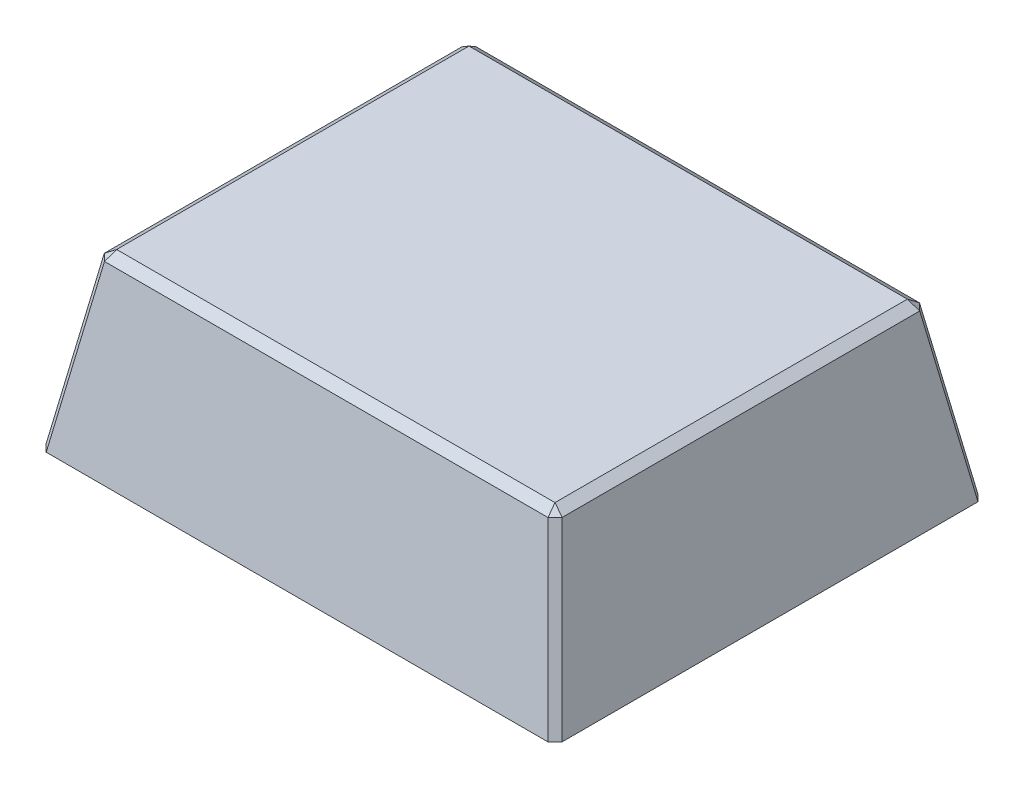
ISO-10303-21;
HEADER;
FILE_DESCRIPTION(('STEP AP214'),'2;1');
FILE_NAME('part.step','',(''),(''),'','','');
FILE_SCHEMA(('AUTOMOTIVE_DESIGN { 1 0 10303 214 1 1 1 1 }'));
ENDSEC;
DATA;
#1=APPLICATION_CONTEXT('core data for automotive mechanical design processes');
#2=APPLICATION_PROTOCOL_DEFINITION('international standard','automotive_design',2000,#1);
#3=PRODUCT_CONTEXT('',#1,'mechanical');
#4=PRODUCT('Part','Part','',(#3));
#5=PRODUCT_RELATED_PRODUCT_CATEGORY('part','',(#4));
#6=PRODUCT_DEFINITION_FORMATION('','',#4);
#7=PRODUCT_DEFINITION_CONTEXT('part definition',#1,'design');
#8=PRODUCT_DEFINITION('design','',#6,#7);
#9=PRODUCT_DEFINITION_SHAPE('','',#8);
#10=(LENGTH_UNIT() NAMED_UNIT(*) SI_UNIT(.MILLI.,.METRE.));
#11=(NAMED_UNIT(*) PLANE_ANGLE_UNIT() SI_UNIT($,.RADIAN.));
#12=(NAMED_UNIT(*) SI_UNIT($,.STERADIAN.) SOLID_ANGLE_UNIT());
#13=UNCERTAINTY_MEASURE_WITH_UNIT(LENGTH_MEASURE(1.E-05),#10,'distance_accuracy_value','');
#14=(GEOMETRIC_REPRESENTATION_CONTEXT(3) GLOBAL_UNCERTAINTY_ASSIGNED_CONTEXT((#13)) GLOBAL_UNIT_ASSIGNED_CONTEXT((#10,
#11,#12)) REPRESENTATION_CONTEXT('',''));
#15=CARTESIAN_POINT('',(0.,0.,0.));
#16=DIRECTION('',(0.,0.,1.));
#17=DIRECTION('',(1.,0.,0.));
#18=AXIS2_PLACEMENT_3D('',#15,#16,#17);
#19=CARTESIAN_POINT('',(0.75,0.3,0.625));
#20=DIRECTION('',(0.984807753012208,0.17364817766693,0.));
#21=DIRECTION('',(-0.17364817766693,0.984807753012208,0.));
#22=AXIS2_PLACEMENT_3D('',#19,#20,#21);
#23=PLANE('',#22);
#24=DIRECTION('',(0.,0.,1.));
#25=VECTOR('',#24,1.);
#26=CARTESIAN_POINT('',(0.665309473199106,0.780303844939755,0.625));
#27=LINE('',#26,#25);
#28=CARTESIAN_POINT('',(0.665309473199106,0.780303844939755,-0.520010175776712));
#29=VERTEX_POINT('',#28);
#30=CARTESIAN_POINT('',(0.665309473199106,0.780303844939755,0.51936922805274));
#31=VERTEX_POINT('',#30);
#32=EDGE_CURVE('E11',#29,#31,#27,.T.);
#33=ORIENTED_EDGE('',*,*,#32,.T.);
#34=DIRECTION('',(0.171087869746036,-0.970287525247814,0.171087869746036));
#35=VECTOR('',#34,1.);
#36=CARTESIAN_POINT('',(0.750612943154802,0.29652382662971,0.604672698008436));
#37=LINE('',#36,#35);
#38=CARTESIAN_POINT('',(0.75,0.3,0.604059754853633));
#39=VERTEX_POINT('',#38);
#40=EDGE_CURVE('E24',#31,#39,#37,.T.);
#41=ORIENTED_EDGE('',*,*,#40,.T.);
#42=DIRECTION('',(0.,0.,-1.));
#43=VECTOR('',#42,1.);
#44=CARTESIAN_POINT('',(0.75,0.3,0.625));
#45=LINE('',#44,#43);
#46=CARTESIAN_POINT('',(0.75,0.3,-0.604700702577606));
#47=VERTEX_POINT('',#46);
#48=EDGE_CURVE('E177',#39,#47,#45,.T.);
#49=ORIENTED_EDGE('',*,*,#48,.T.);
#50=DIRECTION('',(-0.171087869746036,0.970287525247814,0.171087869746036));
#51=VECTOR('',#50,1.);
#52=CARTESIAN_POINT('',(0.714005357968251,0.504135758958307,-0.568706060545857));
#53=LINE('',#52,#51);
#54=EDGE_CURVE('E175',#47,#29,#53,.T.);
#55=ORIENTED_EDGE('',*,*,#54,.T.);
#56=EDGE_LOOP('',(#33,#41,#49,#55));
#57=FACE_BOUND('',#56,.T.);
#58=ADVANCED_FACE('F17',(#57),#23,.T.);
#59=CARTESIAN_POINT('',(-0.75,0.3,-0.625));
#60=DIRECTION('',(0.,0.17364817766693,-0.984807753012208));
#61=DIRECTION('',(0.,0.984807753012208,0.17364817766693));
#62=AXIS2_PLACEMENT_3D('',#59,#60,#61);
#63=PLANE('',#62);
#64=DIRECTION('',(-1.,0.,0.));
#65=VECTOR('',#64,1.);
#66=CARTESIAN_POINT('',(-0.75,0.3,-0.625));
#67=LINE('',#66,#65);
#68=CARTESIAN_POINT('',(0.729059754853634,0.3,-0.625));
#69=VERTEX_POINT('',#68);
#70=CARTESIAN_POINT('',(-0.729700702577606,0.3,-0.625));
#71=VERTEX_POINT('',#70);
#72=EDGE_CURVE('E173',#69,#71,#67,.T.);
#73=ORIENTED_EDGE('',*,*,#72,.T.);
#74=DIRECTION('',(0.171087869746036,0.970287525247814,0.171087869746036));
#75=VECTOR('',#74,1.);
#76=CARTESIAN_POINT('',(-0.730294884513652,0.296630226788555,-0.625594181936046));
#77=LINE('',#76,#75);
#78=CARTESIAN_POINT('',(-0.645010175776712,0.780303844939755,-0.540309473199106));
#79=VERTEX_POINT('',#78);
#80=EDGE_CURVE('E171',#71,#79,#77,.T.);
#81=ORIENTED_EDGE('',*,*,#80,.T.);
#82=DIRECTION('',(1.,0.,0.));
#83=VECTOR('',#82,1.);
#84=CARTESIAN_POINT('',(-0.75,0.780303844939755,-0.540309473199106));
#85=LINE('',#84,#83);
#86=CARTESIAN_POINT('',(0.64436922805274,0.780303844939755,-0.540309473199106));
#87=VERTEX_POINT('',#86);
#88=EDGE_CURVE('E169',#79,#87,#85,.T.);
#89=ORIENTED_EDGE('',*,*,#88,.T.);
#90=DIRECTION('',(0.171087869746036,-0.970287525247814,-0.171087869746036));
#91=VECTOR('',#90,1.);
#92=CARTESIAN_POINT('',(0.685766109247082,0.545530465233412,-0.581706354393448));
#93=LINE('',#92,#91);
#94=EDGE_CURVE('E166',#87,#69,#93,.T.);
#95=ORIENTED_EDGE('',*,*,#94,.T.);
#96=EDGE_LOOP('',(#73,#81,#89,#95));
#97=FACE_BOUND('',#96,.T.);
#98=ADVANCED_FACE('F228',(#97),#63,.T.);
#99=CARTESIAN_POINT('',(-0.75,0.3,0.625));
#100=DIRECTION('',(-0.984807753012208,0.17364817766693,0.));
#101=DIRECTION('',(-0.17364817766693,-0.984807753012208,0.));
#102=AXIS2_PLACEMENT_3D('',#99,#100,#101);
#103=PLANE('',#102);
#104=DIRECTION('',(0.,0.,-1.));
#105=VECTOR('',#104,1.);
#106=CARTESIAN_POINT('',(-0.665309473199106,0.780303844939755,0.625));
#107=LINE('',#106,#105);
#108=CARTESIAN_POINT('',(-0.665309473199106,0.780303844939755,0.520010175776712));
#109=VERTEX_POINT('',#108);
#110=CARTESIAN_POINT('',(-0.665309473199106,0.780303844939755,-0.51936922805274));
#111=VERTEX_POINT('',#110);
#112=EDGE_CURVE('E164',#109,#111,#107,.T.);
#113=ORIENTED_EDGE('',*,*,#112,.T.);
#114=DIRECTION('',(-0.171087869746036,-0.970287525247814,-0.171087869746036));
#115=VECTOR('',#114,1.);
#116=CARTESIAN_POINT('',(-0.714024119187007,0.504029358799462,-0.568083874040641));
#117=LINE('',#116,#115);
#118=CARTESIAN_POINT('',(-0.75,0.3,-0.604059754853635));
#119=VERTEX_POINT('',#118);
#120=EDGE_CURVE('E162',#111,#119,#117,.T.);
#121=ORIENTED_EDGE('',*,*,#120,.T.);
#122=DIRECTION('',(0.,0.,1.));
#123=VECTOR('',#122,1.);
#124=CARTESIAN_POINT('',(-0.75,0.3,0.625));
#125=LINE('',#124,#123);
#126=CARTESIAN_POINT('',(-0.75,0.3,0.604700702577606));
#127=VERTEX_POINT('',#126);
#128=EDGE_CURVE('E160',#119,#127,#125,.T.);
#129=ORIENTED_EDGE('',*,*,#128,.T.);
#130=DIRECTION('',(0.171087869746036,0.970287525247814,-0.171087869746036));
#131=VECTOR('',#130,1.);
#132=CARTESIAN_POINT('',(-0.750594181936047,0.296630226788555,0.605294884513652));
#133=LINE('',#132,#131);
#134=EDGE_CURVE('E157',#127,#109,#133,.T.);
#135=ORIENTED_EDGE('',*,*,#134,.T.);
#136=EDGE_LOOP('',(#113,#121,#129,#135));
#137=FACE_BOUND('',#136,.T.);
#138=ADVANCED_FACE('F218',(#137),#103,.T.);
#139=CARTESIAN_POINT('',(-0.75,0.3,0.625));
#140=DIRECTION('',(0.,0.17364817766693,0.984807753012208));
#141=DIRECTION('',(0.,-0.984807753012208,0.17364817766693));
#142=AXIS2_PLACEMENT_3D('',#139,#140,#141);
#143=PLANE('',#142);
#144=DIRECTION('',(1.,0.,0.));
#145=VECTOR('',#144,1.);
#146=CARTESIAN_POINT('',(-0.75,0.3,0.625));
#147=LINE('',#146,#145);
#148=CARTESIAN_POINT('',(-0.729059754853634,0.3,0.625));
#149=VERTEX_POINT('',#148);
#150=CARTESIAN_POINT('',(0.729700702577605,0.3,0.625));
#151=VERTEX_POINT('',#150);
#152=EDGE_CURVE('E155',#149,#151,#147,.T.);
#153=ORIENTED_EDGE('',*,*,#152,.T.);
#154=DIRECTION('',(-0.171087869746036,0.970287525247814,-0.171087869746036));
#155=VECTOR('',#154,1.);
#156=CARTESIAN_POINT('',(0.686388295752297,0.545636865392257,0.581687593174692));
#157=LINE('',#156,#155);
#158=CARTESIAN_POINT('',(0.645010175776712,0.780303844939755,0.540309473199106));
#159=VERTEX_POINT('',#158);
#160=EDGE_CURVE('E153',#151,#159,#157,.T.);
#161=ORIENTED_EDGE('',*,*,#160,.T.);
#162=DIRECTION('',(-1.,0.,0.));
#163=VECTOR('',#162,1.);
#164=CARTESIAN_POINT('',(-0.75,0.780303844939755,0.540309473199106));
#165=LINE('',#164,#163);
#166=CARTESIAN_POINT('',(-0.64436922805274,0.780303844939755,0.540309473199106));
#167=VERTEX_POINT('',#166);
#168=EDGE_CURVE('E151',#159,#167,#165,.T.);
#169=ORIENTED_EDGE('',*,*,#168,.T.);
#170=DIRECTION('',(-0.171087869746036,-0.970287525247814,0.171087869746036));
#171=VECTOR('',#170,1.);
#172=CARTESIAN_POINT('',(-0.729672698008436,0.29652382662971,0.625612943154802));
#173=LINE('',#172,#171);
#174=EDGE_CURVE('E148',#167,#149,#173,.T.);
#175=ORIENTED_EDGE('',*,*,#174,.T.);
#176=EDGE_LOOP('',(#153,#161,#169,#175));
#177=FACE_BOUND('',#176,.T.);
#178=ADVANCED_FACE('F194',(#177),#143,.T.);
#179=CARTESIAN_POINT('',(0.,0.8,0.));
#180=DIRECTION('',(0.,-1.,0.));
#181=DIRECTION('',(0.,0.,-1.));
#182=AXIS2_PLACEMENT_3D('',#179,#180,#181);
#183=PLANE('',#182);
#184=DIRECTION('',(0.,0.,1.));
#185=VECTOR('',#184,1.);
#186=CARTESIAN_POINT('',(-0.637180448609335,0.8,0.));
#187=LINE('',#186,#185);
#188=CARTESIAN_POINT('',(-0.637180448609335,0.8,-0.512180448609335));
#189=VERTEX_POINT('',#188);
#190=CARTESIAN_POINT('',(-0.637180448609335,0.8,0.512180448609335));
#191=VERTEX_POINT('',#190);
#192=EDGE_CURVE('E146',#189,#191,#187,.T.);
#193=ORIENTED_EDGE('',*,*,#192,.T.);
#194=DIRECTION('',(1.,0.,0.));
#195=VECTOR('',#194,1.);
#196=CARTESIAN_POINT('',(0.,0.8,0.512180448609335));
#197=LINE('',#196,#195);
#198=CARTESIAN_POINT('',(0.637180448609335,0.8,0.512180448609335));
#199=VERTEX_POINT('',#198);
#200=EDGE_CURVE('E96',#191,#199,#197,.T.);
#201=ORIENTED_EDGE('',*,*,#200,.T.);
#202=DIRECTION('',(0.,0.,-1.));
#203=VECTOR('',#202,1.);
#204=CARTESIAN_POINT('',(0.637180448609335,0.8,0.));
#205=LINE('',#204,#203);
#206=CARTESIAN_POINT('',(0.637180448609335,0.8,-0.512180448609335));
#207=VERTEX_POINT('',#206);
#208=EDGE_CURVE('E90',#199,#207,#205,.T.);
#209=ORIENTED_EDGE('',*,*,#208,.T.);
#210=DIRECTION('',(-1.,0.,0.));
#211=VECTOR('',#210,1.);
#212=CARTESIAN_POINT('',(0.,0.8,-0.512180448609335));
#213=LINE('',#212,#211);
#214=EDGE_CURVE('E93',#207,#189,#213,.T.);
#215=ORIENTED_EDGE('',*,*,#214,.T.);
#216=EDGE_LOOP('',(#193,#201,#209,#215));
#217=FACE_BOUND('',#216,.T.);
#218=ADVANCED_FACE('F92',(#217),#183,.F.);
#219=CARTESIAN_POINT('',(0.,0.3,0.));
#220=DIRECTION('',(0.,-1.,0.));
#221=DIRECTION('',(0.,0.,-1.));
#222=AXIS2_PLACEMENT_3D('',#219,#220,#221);
#223=PLANE('',#222);
#224=ORIENTED_EDGE('',*,*,#128,.F.);
#225=DIRECTION('',(0.69603282006317,0.,-0.718009967476017));
#226=VECTOR('',#225,1.);
#227=CARTESIAN_POINT('',(-0.688537733549814,0.3,-0.667462684518496));
#228=LINE('',#227,#226);
#229=EDGE_CURVE('E109',#119,#71,#228,.T.);
#230=ORIENTED_EDGE('',*,*,#229,.T.);
#231=ORIENTED_EDGE('',*,*,#72,.F.);
#232=DIRECTION('',(0.718009967476017,0.,0.69603282006317));
#233=VECTOR('',#232,1.);
#234=CARTESIAN_POINT('',(0.665550582532158,0.3,-0.686565257187424));
#235=LINE('',#234,#233);
#236=EDGE_CURVE('E140',#69,#47,#235,.T.);
#237=ORIENTED_EDGE('',*,*,#236,.T.);
#238=ORIENTED_EDGE('',*,*,#48,.F.);
#239=DIRECTION('',(-0.696032820063169,0.,0.718009967476018));
#240=VECTOR('',#239,1.);
#241=CARTESIAN_POINT('',(0.688537733549814,0.3,0.667462684518495));
#242=LINE('',#241,#240);
#243=EDGE_CURVE('E137',#39,#151,#242,.T.);
#244=ORIENTED_EDGE('',*,*,#243,.T.);
#245=ORIENTED_EDGE('',*,*,#152,.F.);
#246=DIRECTION('',(-0.718009967476018,0.,-0.696032820063168));
#247=VECTOR('',#246,1.);
#248=CARTESIAN_POINT('',(-0.665550582532156,0.3,0.686565257187426));
#249=LINE('',#248,#247);
#250=EDGE_CURVE('E134',#149,#127,#249,.T.);
#251=ORIENTED_EDGE('',*,*,#250,.T.);
#252=EDGE_LOOP('',(#224,#230,#231,#237,#238,#244,#245,#251));
#253=FACE_BOUND('',#252,.T.);
#254=ADVANCED_FACE('F185',(#253),#223,.T.);
#255=CARTESIAN_POINT('',(-0.714024119187007,0.504029358799462,-0.568083874040641));
#256=DIRECTION('',(0.696681039223028,-0.241927278412641,0.675356736508176));
#257=DIRECTION('',(-0.171087869746036,-0.970287525247814,-0.171087869746036));
#258=AXIS2_PLACEMENT_3D('',#255,#256,#257);
#259=PLANE('',#258);
#260=ORIENTED_EDGE('',*,*,#229,.F.);
#261=ORIENTED_EDGE('',*,*,#120,.F.);
#262=DIRECTION('',(-0.69603282006317,0.,0.718009967476017));
#263=VECTOR('',#262,1.);
#264=CARTESIAN_POINT('',(-0.665309473199106,0.780303844939755,-0.51936922805274));
#265=LINE('',#264,#263);
#266=EDGE_CURVE('E117',#79,#111,#265,.T.);
#267=ORIENTED_EDGE('',*,*,#266,.F.);
#268=ORIENTED_EDGE('',*,*,#80,.F.);
#269=EDGE_LOOP('',(#260,#261,#267,#268));
#270=FACE_BOUND('',#269,.T.);
#271=ADVANCED_FACE('F225',(#270),#259,.F.);
#272=CARTESIAN_POINT('',(0.,0.8,-0.512180448609335));
#273=DIRECTION('',(0.,0.819152044288988,-0.573576436351051));
#274=DIRECTION('',(1.,0.,0.));
#275=AXIS2_PLACEMENT_3D('',#272,#273,#274);
#276=PLANE('',#275);
#277=DIRECTION('',(-0.204904260787713,0.561406303358167,0.801771293113415));
#278=VECTOR('',#277,1.);
#279=CARTESIAN_POINT('',(0.64436922805274,0.780303844939755,-0.540309473199106));
#280=LINE('',#279,#278);
#281=EDGE_CURVE('E104',#87,#207,#280,.T.);
#282=ORIENTED_EDGE('',*,*,#281,.F.);
#283=ORIENTED_EDGE('',*,*,#88,.F.);
#284=DIRECTION('',(-0.222305823523873,-0.559223824447544,-0.798654390207451));
#285=VECTOR('',#284,1.);
#286=CARTESIAN_POINT('',(-0.642295517848846,0.787132732120596,-0.530556811583522));
#287=LINE('',#286,#285);
#288=EDGE_CURVE('E107',#189,#79,#287,.T.);
#289=ORIENTED_EDGE('',*,*,#288,.F.);
#290=ORIENTED_EDGE('',*,*,#214,.F.);
#291=EDGE_LOOP('',(#282,#283,#289,#290));
#292=FACE_BOUND('',#291,.T.);
#293=ADVANCED_FACE('F102',(#292),#276,.T.);
#294=CARTESIAN_POINT('',(0.685766109247081,0.545530465233412,-0.581706354393448));
#295=DIRECTION('',(-0.675356736508176,-0.241927278412641,0.696681039223028));
#296=DIRECTION('',(0.171087869746036,-0.970287525247814,-0.171087869746036));
#297=AXIS2_PLACEMENT_3D('',#294,#295,#296);
#298=PLANE('',#297);
#299=ORIENTED_EDGE('',*,*,#236,.F.);
#300=ORIENTED_EDGE('',*,*,#94,.F.);
#301=DIRECTION('',(-0.718009967476017,0.,-0.69603282006317));
#302=VECTOR('',#301,1.);
#303=CARTESIAN_POINT('',(0.64436922805274,0.780303844939755,-0.540309473199106));
#304=LINE('',#303,#302);
#305=EDGE_CURVE('E116',#29,#87,#304,.T.);
#306=ORIENTED_EDGE('',*,*,#305,.F.);
#307=ORIENTED_EDGE('',*,*,#54,.F.);
#308=EDGE_LOOP('',(#299,#300,#306,#307));
#309=FACE_BOUND('',#308,.T.);
#310=ADVANCED_FACE('F231',(#309),#298,.F.);
#311=CARTESIAN_POINT('',(-0.665309473199106,0.780303844939755,-0.51936922805274));
#312=DIRECTION('',(-0.442153251808436,0.78789955257701,-0.428619641365364));
#313=DIRECTION('',(-0.872067078785767,-0.489386360760146,0.));
#314=AXIS2_PLACEMENT_3D('',#311,#312,#313);
#315=PLANE('',#314);
#316=ORIENTED_EDGE('',*,*,#288,.T.);
#317=ORIENTED_EDGE('',*,*,#266,.T.);
#318=DIRECTION('',(-0.801771293113415,-0.561406303358169,-0.204904260787711));
#319=VECTOR('',#318,1.);
#320=CARTESIAN_POINT('',(-0.665309473199106,0.780303844939755,-0.51936922805274));
#321=LINE('',#320,#319);
#322=EDGE_CURVE('E120',#189,#111,#321,.T.);
#323=ORIENTED_EDGE('',*,*,#322,.F.);
#324=EDGE_LOOP('',(#316,#317,#323));
#325=FACE_BOUND('',#324,.T.);
#326=ADVANCED_FACE('F233',(#325),#315,.T.);
#327=CARTESIAN_POINT('',(0.64436922805274,0.780303844939755,-0.540309473199106));
#328=DIRECTION('',(0.428619641365363,0.787899552577012,-0.442153251808434));
#329=DIRECTION('',(0.,0.489386360760144,0.872067078785768));
#330=AXIS2_PLACEMENT_3D('',#327,#328,#329);
#331=PLANE('',#330);
#332=ORIENTED_EDGE('',*,*,#305,.T.);
#333=ORIENTED_EDGE('',*,*,#281,.T.);
#334=DIRECTION('',(-0.798654390207448,0.559223824447544,0.222305823523882));
#335=VECTOR('',#334,1.);
#336=CARTESIAN_POINT('',(0.655556811583522,0.787132732120596,-0.517295517848846));
#337=LINE('',#336,#335);
#338=EDGE_CURVE('E114',#29,#207,#337,.T.);
#339=ORIENTED_EDGE('',*,*,#338,.F.);
#340=EDGE_LOOP('',(#332,#333,#339));
#341=FACE_BOUND('',#340,.T.);
#342=ADVANCED_FACE('F113',(#341),#331,.T.);
#343=CARTESIAN_POINT('',(-0.729672698008436,0.29652382662971,0.625612943154802));
#344=DIRECTION('',(0.675356736508174,-0.241927278412641,-0.69668103922303));
#345=DIRECTION('',(-0.171087869746036,-0.970287525247814,0.171087869746036));
#346=AXIS2_PLACEMENT_3D('',#343,#344,#345);
#347=PLANE('',#346);
#348=ORIENTED_EDGE('',*,*,#250,.F.);
#349=ORIENTED_EDGE('',*,*,#174,.F.);
#350=DIRECTION('',(0.718009967476019,0.,0.696032820063168));
#351=VECTOR('',#350,1.);
#352=CARTESIAN_POINT('',(-0.64436922805274,0.780303844939755,0.540309473199106));
#353=LINE('',#352,#351);
#354=EDGE_CURVE('E121',#109,#167,#353,.T.);
#355=ORIENTED_EDGE('',*,*,#354,.F.);
#356=ORIENTED_EDGE('',*,*,#134,.F.);
#357=EDGE_LOOP('',(#348,#349,#355,#356));
#358=FACE_BOUND('',#357,.T.);
#359=ADVANCED_FACE('F221',(#358),#347,.F.);
#360=CARTESIAN_POINT('',(-0.637180448609335,0.8,0.));
#361=DIRECTION('',(-0.573576436351052,0.819152044288987,0.));
#362=DIRECTION('',(0.,0.,-1.));
#363=AXIS2_PLACEMENT_3D('',#360,#361,#362);
#364=PLANE('',#363);
#365=ORIENTED_EDGE('',*,*,#322,.T.);
#366=ORIENTED_EDGE('',*,*,#112,.F.);
#367=DIRECTION('',(-0.79865439020745,-0.559223824447545,0.222305823523873));
#368=VECTOR('',#367,1.);
#369=CARTESIAN_POINT('',(-0.655556811583522,0.787132732120596,0.517295517848845));
#370=LINE('',#369,#368);
#371=EDGE_CURVE('E126',#191,#109,#370,.T.);
#372=ORIENTED_EDGE('',*,*,#371,.F.);
#373=ORIENTED_EDGE('',*,*,#192,.F.);
#374=EDGE_LOOP('',(#365,#366,#372,#373));
#375=FACE_BOUND('',#374,.T.);
#376=ADVANCED_FACE('F214',(#375),#364,.T.);
#377=CARTESIAN_POINT('',(0.637180448609335,0.8,0.));
#378=DIRECTION('',(0.573576436351052,0.819152044288987,0.));
#379=DIRECTION('',(0.,0.,1.));
#380=AXIS2_PLACEMENT_3D('',#377,#378,#379);
#381=PLANE('',#380);
#382=ORIENTED_EDGE('',*,*,#338,.T.);
#383=ORIENTED_EDGE('',*,*,#208,.F.);
#384=DIRECTION('',(-0.801771293113417,0.561406303358171,-0.204904260787699));
#385=VECTOR('',#384,1.);
#386=CARTESIAN_POINT('',(0.637180448609335,0.8,0.512180448609335));
#387=LINE('',#386,#385);
#388=EDGE_CURVE('E207',#31,#199,#387,.T.);
#389=ORIENTED_EDGE('',*,*,#388,.F.);
#390=ORIENTED_EDGE('',*,*,#32,.F.);
#391=EDGE_LOOP('',(#382,#383,#389,#390));
#392=FACE_BOUND('',#391,.T.);
#393=ADVANCED_FACE('F119',(#392),#381,.T.);
#394=CARTESIAN_POINT('',(0.750612943154802,0.29652382662971,0.604672698008436));
#395=DIRECTION('',(-0.696681039223029,-0.241927278412641,-0.675356736508175));
#396=DIRECTION('',(0.171087869746036,-0.970287525247814,0.171087869746036));
#397=AXIS2_PLACEMENT_3D('',#394,#395,#396);
#398=PLANE('',#397);
#399=ORIENTED_EDGE('',*,*,#243,.F.);
#400=ORIENTED_EDGE('',*,*,#40,.F.);
#401=DIRECTION('',(0.696032820063169,0.,-0.718009967476018));
#402=VECTOR('',#401,1.);
#403=CARTESIAN_POINT('',(0.655274692153198,0.780303844939755,0.52972085602877));
#404=LINE('',#403,#402);
#405=EDGE_CURVE('E190',#159,#31,#404,.T.);
#406=ORIENTED_EDGE('',*,*,#405,.F.);
#407=ORIENTED_EDGE('',*,*,#160,.F.);
#408=EDGE_LOOP('',(#399,#400,#406,#407));
#409=FACE_BOUND('',#408,.T.);
#410=ADVANCED_FACE('F188',(#409),#398,.F.);
#411=CARTESIAN_POINT('',(-0.64436922805274,0.780303844939755,0.540309473199106));
#412=DIRECTION('',(-0.428619641365364,0.787899552577008,0.442153251808438));
#413=DIRECTION('',(0.,-0.489386360760149,0.872067078785765));
#414=AXIS2_PLACEMENT_3D('',#411,#412,#413);
#415=PLANE('',#414);
#416=ORIENTED_EDGE('',*,*,#371,.T.);
#417=ORIENTED_EDGE('',*,*,#354,.T.);
#418=DIRECTION('',(-0.204904260787705,-0.56140630335817,0.801771293113416));
#419=VECTOR('',#418,1.);
#420=CARTESIAN_POINT('',(-0.64436922805274,0.780303844939755,0.540309473199106));
#421=LINE('',#420,#419);
#422=EDGE_CURVE('E202',#191,#167,#421,.T.);
#423=ORIENTED_EDGE('',*,*,#422,.F.);
#424=EDGE_LOOP('',(#416,#417,#423));
#425=FACE_BOUND('',#424,.T.);
#426=ADVANCED_FACE('F211',(#425),#415,.T.);
#427=CARTESIAN_POINT('',(0.637180448609335,0.8,0.512180448609335));
#428=DIRECTION('',(0.44215325180844,0.787899552577007,0.428619641365366));
#429=DIRECTION('',(-0.872067078785764,0.489386360760151,0.));
#430=AXIS2_PLACEMENT_3D('',#427,#428,#429);
#431=PLANE('',#430);
#432=ORIENTED_EDGE('',*,*,#405,.T.);
#433=ORIENTED_EDGE('',*,*,#388,.T.);
#434=DIRECTION('',(-0.222305823523867,0.559223824447546,-0.798654390207451));
#435=VECTOR('',#434,1.);
#436=CARTESIAN_POINT('',(0.637180448609335,0.8,0.512180448609335));
#437=LINE('',#436,#435);
#438=EDGE_CURVE('E200',#159,#199,#437,.T.);
#439=ORIENTED_EDGE('',*,*,#438,.F.);
#440=EDGE_LOOP('',(#432,#433,#439));
#441=FACE_BOUND('',#440,.T.);
#442=ADVANCED_FACE('F331',(#441),#431,.T.);
#443=CARTESIAN_POINT('',(0.,0.8,0.512180448609335));
#444=DIRECTION('',(0.,0.819152044288987,0.573576436351052));
#445=DIRECTION('',(-1.,0.,0.));
#446=AXIS2_PLACEMENT_3D('',#443,#444,#445);
#447=PLANE('',#446);
#448=ORIENTED_EDGE('',*,*,#422,.T.);
#449=ORIENTED_EDGE('',*,*,#168,.F.);
#450=ORIENTED_EDGE('',*,*,#438,.T.);
#451=ORIENTED_EDGE('',*,*,#200,.F.);
#452=EDGE_LOOP('',(#448,#449,#450,#451));
#453=FACE_BOUND('',#452,.T.);
#454=ADVANCED_FACE('F199',(#453),#447,.T.);
#455=CLOSED_SHELL('',(#58,#98,#138,#178,#218,#254,#271,#293,#310,#326,#342,#359,#376,#393,#410,
#426,#442,#454));
#456=MANIFOLD_SOLID_BREP('B1',#455);
#457=ADVANCED_BREP_SHAPE_REPRESENTATION('',(#18,#456),#14);
#458=SHAPE_DEFINITION_REPRESENTATION(#9,#457);
ENDSEC;
END-ISO-10303-21;
